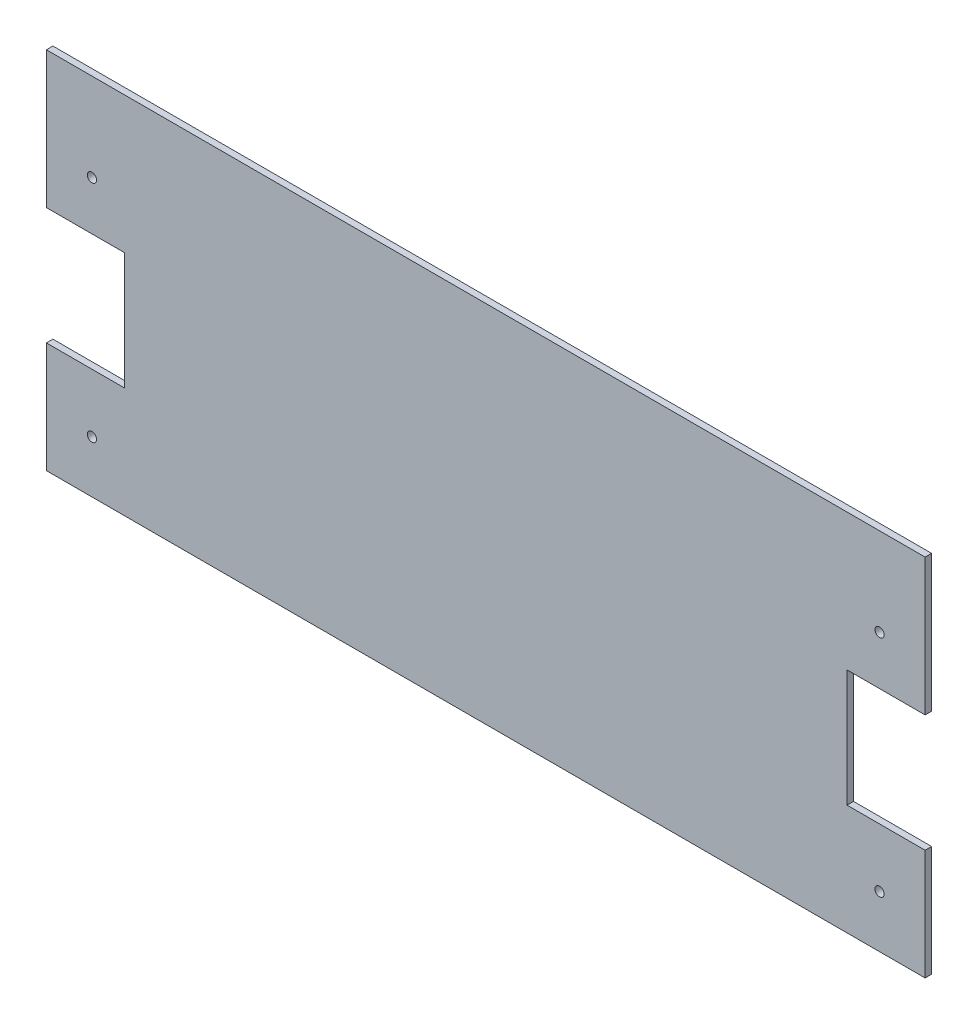
ISO-10303-21;
HEADER;
FILE_DESCRIPTION(('STEP AP214'),'2;1');
FILE_NAME('part.step','',(''),(''),'','','');
FILE_SCHEMA(('AUTOMOTIVE_DESIGN { 1 0 10303 214 1 1 1 1 }'));
ENDSEC;
DATA;
#1=APPLICATION_CONTEXT('core data for automotive mechanical design processes');
#2=APPLICATION_PROTOCOL_DEFINITION('international standard','automotive_design',2000,#1);
#3=PRODUCT_CONTEXT('',#1,'mechanical');
#4=PRODUCT('Part','Part','',(#3));
#5=PRODUCT_RELATED_PRODUCT_CATEGORY('part','',(#4));
#6=PRODUCT_DEFINITION_FORMATION('','',#4);
#7=PRODUCT_DEFINITION_CONTEXT('part definition',#1,'design');
#8=PRODUCT_DEFINITION('design','',#6,#7);
#9=PRODUCT_DEFINITION_SHAPE('','',#8);
#10=(LENGTH_UNIT() NAMED_UNIT(*) SI_UNIT(.MILLI.,.METRE.));
#11=(NAMED_UNIT(*) PLANE_ANGLE_UNIT() SI_UNIT($,.RADIAN.));
#12=(NAMED_UNIT(*) SI_UNIT($,.STERADIAN.) SOLID_ANGLE_UNIT());
#13=UNCERTAINTY_MEASURE_WITH_UNIT(LENGTH_MEASURE(1.E-05),#10,'distance_accuracy_value','');
#14=(GEOMETRIC_REPRESENTATION_CONTEXT(3) GLOBAL_UNCERTAINTY_ASSIGNED_CONTEXT((#13)) GLOBAL_UNIT_ASSIGNED_CONTEXT((#10,
#11,#12)) REPRESENTATION_CONTEXT('',''));
#15=CARTESIAN_POINT('',(0.,0.,0.));
#16=DIRECTION('',(0.,0.,1.));
#17=DIRECTION('',(1.,0.,0.));
#18=AXIS2_PLACEMENT_3D('',#15,#16,#17);
#19=CARTESIAN_POINT('',(214.3125,0.,-3.175));
#20=DIRECTION('',(1.,0.,0.));
#21=DIRECTION('',(0.,0.,-1.));
#22=AXIS2_PLACEMENT_3D('',#19,#20,#21);
#23=PLANE('',#22);
#24=DIRECTION('',(0.,1.,0.));
#25=VECTOR('',#24,1.);
#26=CARTESIAN_POINT('',(214.3125,0.,0.));
#27=LINE('',#26,#25);
#28=CARTESIAN_POINT('',(214.3125,-88.9,0.));
#29=VERTEX_POINT('',#28);
#30=CARTESIAN_POINT('',(214.3125,-34.925,0.));
#31=VERTEX_POINT('',#30);
#32=EDGE_CURVE('E191',#29,#31,#27,.T.);
#33=ORIENTED_EDGE('',*,*,#32,.F.);
#34=DIRECTION('',(0.,0.,1.));
#35=VECTOR('',#34,1.);
#36=CARTESIAN_POINT('',(214.3125,-88.9,-3.175));
#37=LINE('',#36,#35);
#38=CARTESIAN_POINT('',(214.3125,-88.9,-3.175));
#39=VERTEX_POINT('',#38);
#40=EDGE_CURVE('E11',#39,#29,#37,.T.);
#41=ORIENTED_EDGE('',*,*,#40,.F.);
#42=DIRECTION('',(0.,1.,0.));
#43=VECTOR('',#42,1.);
#44=CARTESIAN_POINT('',(214.3125,0.,-3.175));
#45=LINE('',#44,#43);
#46=CARTESIAN_POINT('',(214.3125,-34.925,-3.175));
#47=VERTEX_POINT('',#46);
#48=EDGE_CURVE('E237',#39,#47,#45,.T.);
#49=ORIENTED_EDGE('',*,*,#48,.T.);
#50=DIRECTION('',(0.,0.,1.));
#51=VECTOR('',#50,1.);
#52=CARTESIAN_POINT('',(214.3125,-34.925,-3.175));
#53=LINE('',#52,#51);
#54=EDGE_CURVE('E43',#47,#31,#53,.T.);
#55=ORIENTED_EDGE('',*,*,#54,.T.);
#56=EDGE_LOOP('',(#33,#41,#49,#55));
#57=FACE_BOUND('',#56,.T.);
#58=ADVANCED_FACE('F39',(#57),#23,.T.);
#59=CARTESIAN_POINT('',(0.,-88.9,-3.175));
#60=DIRECTION('',(0.,-1.,0.));
#61=DIRECTION('',(0.,0.,-1.));
#62=AXIS2_PLACEMENT_3D('',#59,#60,#61);
#63=PLANE('',#62);
#64=DIRECTION('',(1.,0.,0.));
#65=VECTOR('',#64,1.);
#66=CARTESIAN_POINT('',(0.,-88.9,0.));
#67=LINE('',#66,#65);
#68=CARTESIAN_POINT('',(-214.3125,-88.9,0.));
#69=VERTEX_POINT('',#68);
#70=EDGE_CURVE('E218',#69,#29,#67,.T.);
#71=ORIENTED_EDGE('',*,*,#70,.F.);
#72=DIRECTION('',(0.,0.,1.));
#73=VECTOR('',#72,1.);
#74=CARTESIAN_POINT('',(-214.3125,-88.9,-3.175));
#75=LINE('',#74,#73);
#76=CARTESIAN_POINT('',(-214.3125,-88.9,-3.175));
#77=VERTEX_POINT('',#76);
#78=EDGE_CURVE('E49',#77,#69,#75,.T.);
#79=ORIENTED_EDGE('',*,*,#78,.F.);
#80=DIRECTION('',(1.,0.,0.));
#81=VECTOR('',#80,1.);
#82=CARTESIAN_POINT('',(0.,-88.9,-3.175));
#83=LINE('',#82,#81);
#84=EDGE_CURVE('E152',#77,#39,#83,.T.);
#85=ORIENTED_EDGE('',*,*,#84,.T.);
#86=ORIENTED_EDGE('',*,*,#40,.T.);
#87=EDGE_LOOP('',(#71,#79,#85,#86));
#88=FACE_BOUND('',#87,.T.);
#89=ADVANCED_FACE('F295',(#88),#63,.T.);
#90=CARTESIAN_POINT('',(-214.3125,0.,-3.175));
#91=DIRECTION('',(1.,0.,0.));
#92=DIRECTION('',(0.,0.,-1.));
#93=AXIS2_PLACEMENT_3D('',#90,#91,#92);
#94=PLANE('',#93);
#95=DIRECTION('',(0.,1.,0.));
#96=VECTOR('',#95,1.);
#97=CARTESIAN_POINT('',(-214.3125,0.,0.));
#98=LINE('',#97,#96);
#99=CARTESIAN_POINT('',(-214.3125,-34.925,0.));
#100=VERTEX_POINT('',#99);
#101=EDGE_CURVE('E156',#69,#100,#98,.T.);
#102=ORIENTED_EDGE('',*,*,#101,.T.);
#103=DIRECTION('',(0.,0.,1.));
#104=VECTOR('',#103,1.);
#105=CARTESIAN_POINT('',(-214.3125,-34.925,-3.175));
#106=LINE('',#105,#104);
#107=CARTESIAN_POINT('',(-214.3125,-34.925,-3.175));
#108=VERTEX_POINT('',#107);
#109=EDGE_CURVE('E142',#108,#100,#106,.T.);
#110=ORIENTED_EDGE('',*,*,#109,.F.);
#111=DIRECTION('',(0.,1.,0.));
#112=VECTOR('',#111,1.);
#113=CARTESIAN_POINT('',(-214.3125,0.,-3.175));
#114=LINE('',#113,#112);
#115=EDGE_CURVE('E146',#77,#108,#114,.T.);
#116=ORIENTED_EDGE('',*,*,#115,.F.);
#117=ORIENTED_EDGE('',*,*,#78,.T.);
#118=EDGE_LOOP('',(#102,#110,#116,#117));
#119=FACE_BOUND('',#118,.T.);
#120=ADVANCED_FACE('F155',(#119),#94,.F.);
#121=CARTESIAN_POINT('',(0.,-34.925,-3.175));
#122=DIRECTION('',(0.,-1.,0.));
#123=DIRECTION('',(0.,0.,-1.));
#124=AXIS2_PLACEMENT_3D('',#121,#122,#123);
#125=PLANE('',#124);
#126=DIRECTION('',(1.,0.,0.));
#127=VECTOR('',#126,1.);
#128=CARTESIAN_POINT('',(0.,-34.925,0.));
#129=LINE('',#128,#127);
#130=CARTESIAN_POINT('',(-176.2125,-34.925,0.));
#131=VERTEX_POINT('',#130);
#132=EDGE_CURVE('E216',#100,#131,#129,.T.);
#133=ORIENTED_EDGE('',*,*,#132,.T.);
#134=DIRECTION('',(0.,0.,1.));
#135=VECTOR('',#134,1.);
#136=CARTESIAN_POINT('',(-176.2125,-34.925,-3.175));
#137=LINE('',#136,#135);
#138=CARTESIAN_POINT('',(-176.2125,-34.925,-3.175));
#139=VERTEX_POINT('',#138);
#140=EDGE_CURVE('E144',#139,#131,#137,.T.);
#141=ORIENTED_EDGE('',*,*,#140,.F.);
#142=DIRECTION('',(1.,0.,0.));
#143=VECTOR('',#142,1.);
#144=CARTESIAN_POINT('',(0.,-34.925,-3.175));
#145=LINE('',#144,#143);
#146=EDGE_CURVE('E137',#108,#139,#145,.T.);
#147=ORIENTED_EDGE('',*,*,#146,.F.);
#148=ORIENTED_EDGE('',*,*,#109,.T.);
#149=EDGE_LOOP('',(#133,#141,#147,#148));
#150=FACE_BOUND('',#149,.T.);
#151=ADVANCED_FACE('F140',(#150),#125,.F.);
#152=CARTESIAN_POINT('',(-176.2125,0.,-3.175));
#153=DIRECTION('',(1.,0.,0.));
#154=DIRECTION('',(0.,0.,-1.));
#155=AXIS2_PLACEMENT_3D('',#152,#153,#154);
#156=PLANE('',#155);
#157=DIRECTION('',(0.,1.,0.));
#158=VECTOR('',#157,1.);
#159=CARTESIAN_POINT('',(-176.2125,0.,0.));
#160=LINE('',#159,#158);
#161=CARTESIAN_POINT('',(-176.2125,22.225,0.));
#162=VERTEX_POINT('',#161);
#163=EDGE_CURVE('E213',#131,#162,#160,.T.);
#164=ORIENTED_EDGE('',*,*,#163,.T.);
#165=DIRECTION('',(0.,0.,1.));
#166=VECTOR('',#165,1.);
#167=CARTESIAN_POINT('',(-176.2125,22.225,-3.175));
#168=LINE('',#167,#166);
#169=CARTESIAN_POINT('',(-176.2125,22.225,-3.175));
#170=VERTEX_POINT('',#169);
#171=EDGE_CURVE('E159',#170,#162,#168,.T.);
#172=ORIENTED_EDGE('',*,*,#171,.F.);
#173=DIRECTION('',(0.,1.,0.));
#174=VECTOR('',#173,1.);
#175=CARTESIAN_POINT('',(-176.2125,0.,-3.175));
#176=LINE('',#175,#174);
#177=EDGE_CURVE('E147',#139,#170,#176,.T.);
#178=ORIENTED_EDGE('',*,*,#177,.F.);
#179=ORIENTED_EDGE('',*,*,#140,.T.);
#180=EDGE_LOOP('',(#164,#172,#178,#179));
#181=FACE_BOUND('',#180,.T.);
#182=ADVANCED_FACE('F256',(#181),#156,.F.);
#183=CARTESIAN_POINT('',(0.,22.225,-3.175));
#184=DIRECTION('',(0.,-1.,0.));
#185=DIRECTION('',(0.,0.,-1.));
#186=AXIS2_PLACEMENT_3D('',#183,#184,#185);
#187=PLANE('',#186);
#188=DIRECTION('',(1.,0.,0.));
#189=VECTOR('',#188,1.);
#190=CARTESIAN_POINT('',(0.,22.225,0.));
#191=LINE('',#190,#189);
#192=CARTESIAN_POINT('',(-214.3125,22.225,0.));
#193=VERTEX_POINT('',#192);
#194=EDGE_CURVE('E210',#193,#162,#191,.T.);
#195=ORIENTED_EDGE('',*,*,#194,.F.);
#196=DIRECTION('',(0.,0.,1.));
#197=VECTOR('',#196,1.);
#198=CARTESIAN_POINT('',(-214.3125,22.225,-3.175));
#199=LINE('',#198,#197);
#200=CARTESIAN_POINT('',(-214.3125,22.225,-3.175));
#201=VERTEX_POINT('',#200);
#202=EDGE_CURVE('E163',#201,#193,#199,.T.);
#203=ORIENTED_EDGE('',*,*,#202,.F.);
#204=DIRECTION('',(1.,0.,0.));
#205=VECTOR('',#204,1.);
#206=CARTESIAN_POINT('',(0.,22.225,-3.175));
#207=LINE('',#206,#205);
#208=EDGE_CURVE('E250',#201,#170,#207,.T.);
#209=ORIENTED_EDGE('',*,*,#208,.T.);
#210=ORIENTED_EDGE('',*,*,#171,.T.);
#211=EDGE_LOOP('',(#195,#203,#209,#210));
#212=FACE_BOUND('',#211,.T.);
#213=ADVANCED_FACE('F259',(#212),#187,.T.);
#214=CARTESIAN_POINT('',(-214.3125,88.9,0.));
#215=VERTEX_POINT('',#214);
#216=EDGE_CURVE('E207',#193,#215,#98,.T.);
#217=ORIENTED_EDGE('',*,*,#216,.T.);
#218=DIRECTION('',(0.,0.,1.));
#219=VECTOR('',#218,1.);
#220=CARTESIAN_POINT('',(-214.3125,88.9,-3.175));
#221=LINE('',#220,#219);
#222=CARTESIAN_POINT('',(-214.3125,88.9,-3.175));
#223=VERTEX_POINT('',#222);
#224=EDGE_CURVE('E165',#223,#215,#221,.T.);
#225=ORIENTED_EDGE('',*,*,#224,.F.);
#226=EDGE_CURVE('E154',#201,#223,#114,.T.);
#227=ORIENTED_EDGE('',*,*,#226,.F.);
#228=ORIENTED_EDGE('',*,*,#202,.T.);
#229=EDGE_LOOP('',(#217,#225,#227,#228));
#230=FACE_BOUND('',#229,.T.);
#231=ADVANCED_FACE('F264',(#230),#94,.F.);
#232=CARTESIAN_POINT('',(0.,88.9,-3.175));
#233=DIRECTION('',(0.,-1.,0.));
#234=DIRECTION('',(0.,0.,-1.));
#235=AXIS2_PLACEMENT_3D('',#232,#233,#234);
#236=PLANE('',#235);
#237=DIRECTION('',(1.,0.,0.));
#238=VECTOR('',#237,1.);
#239=CARTESIAN_POINT('',(0.,88.9,0.));
#240=LINE('',#239,#238);
#241=CARTESIAN_POINT('',(214.3125,88.9,0.));
#242=VERTEX_POINT('',#241);
#243=EDGE_CURVE('E204',#215,#242,#240,.T.);
#244=ORIENTED_EDGE('',*,*,#243,.T.);
#245=DIRECTION('',(0.,0.,1.));
#246=VECTOR('',#245,1.);
#247=CARTESIAN_POINT('',(214.3125,88.9,-3.175));
#248=LINE('',#247,#246);
#249=CARTESIAN_POINT('',(214.3125,88.9,-3.175));
#250=VERTEX_POINT('',#249);
#251=EDGE_CURVE('E168',#250,#242,#248,.T.);
#252=ORIENTED_EDGE('',*,*,#251,.F.);
#253=DIRECTION('',(1.,0.,0.));
#254=VECTOR('',#253,1.);
#255=CARTESIAN_POINT('',(0.,88.9,-3.175));
#256=LINE('',#255,#254);
#257=EDGE_CURVE('E247',#223,#250,#256,.T.);
#258=ORIENTED_EDGE('',*,*,#257,.F.);
#259=ORIENTED_EDGE('',*,*,#224,.T.);
#260=EDGE_LOOP('',(#244,#252,#258,#259));
#261=FACE_BOUND('',#260,.T.);
#262=ADVANCED_FACE('F269',(#261),#236,.F.);
#263=CARTESIAN_POINT('',(214.3125,22.225,0.));
#264=VERTEX_POINT('',#263);
#265=EDGE_CURVE('E195',#264,#242,#27,.T.);
#266=ORIENTED_EDGE('',*,*,#265,.F.);
#267=DIRECTION('',(0.,0.,1.));
#268=VECTOR('',#267,1.);
#269=CARTESIAN_POINT('',(214.3125,22.225,-3.175));
#270=LINE('',#269,#268);
#271=CARTESIAN_POINT('',(214.3125,22.225,-3.175));
#272=VERTEX_POINT('',#271);
#273=EDGE_CURVE('E170',#272,#264,#270,.T.);
#274=ORIENTED_EDGE('',*,*,#273,.F.);
#275=EDGE_CURVE('E240',#272,#250,#45,.T.);
#276=ORIENTED_EDGE('',*,*,#275,.T.);
#277=ORIENTED_EDGE('',*,*,#251,.T.);
#278=EDGE_LOOP('',(#266,#274,#276,#277));
#279=FACE_BOUND('',#278,.T.);
#280=ADVANCED_FACE('F273',(#279),#23,.T.);
#281=CARTESIAN_POINT('',(0.,22.225,-3.175));
#282=DIRECTION('',(0.,1.,0.));
#283=DIRECTION('',(0.,0.,1.));
#284=AXIS2_PLACEMENT_3D('',#281,#282,#283);
#285=PLANE('',#284);
#286=DIRECTION('',(-1.,0.,0.));
#287=VECTOR('',#286,1.);
#288=CARTESIAN_POINT('',(0.,22.225,0.));
#289=LINE('',#288,#287);
#290=CARTESIAN_POINT('',(176.2125,22.225,0.));
#291=VERTEX_POINT('',#290);
#292=EDGE_CURVE('E201',#264,#291,#289,.T.);
#293=ORIENTED_EDGE('',*,*,#292,.T.);
#294=DIRECTION('',(0.,0.,1.));
#295=VECTOR('',#294,1.);
#296=CARTESIAN_POINT('',(176.2125,22.225,-3.175));
#297=LINE('',#296,#295);
#298=CARTESIAN_POINT('',(176.2125,22.225,-3.175));
#299=VERTEX_POINT('',#298);
#300=EDGE_CURVE('E172',#299,#291,#297,.T.);
#301=ORIENTED_EDGE('',*,*,#300,.F.);
#302=DIRECTION('',(-1.,0.,0.));
#303=VECTOR('',#302,1.);
#304=CARTESIAN_POINT('',(0.,22.225,-3.175));
#305=LINE('',#304,#303);
#306=EDGE_CURVE('E245',#272,#299,#305,.T.);
#307=ORIENTED_EDGE('',*,*,#306,.F.);
#308=ORIENTED_EDGE('',*,*,#273,.T.);
#309=EDGE_LOOP('',(#293,#301,#307,#308));
#310=FACE_BOUND('',#309,.T.);
#311=ADVANCED_FACE('F278',(#310),#285,.F.);
#312=CARTESIAN_POINT('',(176.2125,0.,-3.175));
#313=DIRECTION('',(1.,0.,0.));
#314=DIRECTION('',(0.,0.,-1.));
#315=AXIS2_PLACEMENT_3D('',#312,#313,#314);
#316=PLANE('',#315);
#317=DIRECTION('',(0.,1.,0.));
#318=VECTOR('',#317,1.);
#319=CARTESIAN_POINT('',(176.2125,0.,0.));
#320=LINE('',#319,#318);
#321=CARTESIAN_POINT('',(176.2125,-34.925,0.));
#322=VERTEX_POINT('',#321);
#323=EDGE_CURVE('E198',#322,#291,#320,.T.);
#324=ORIENTED_EDGE('',*,*,#323,.F.);
#325=DIRECTION('',(0.,0.,1.));
#326=VECTOR('',#325,1.);
#327=CARTESIAN_POINT('',(176.2125,-34.925,-3.175));
#328=LINE('',#327,#326);
#329=CARTESIAN_POINT('',(176.2125,-34.925,-3.175));
#330=VERTEX_POINT('',#329);
#331=EDGE_CURVE('E173',#330,#322,#328,.T.);
#332=ORIENTED_EDGE('',*,*,#331,.F.);
#333=DIRECTION('',(0.,1.,0.));
#334=VECTOR('',#333,1.);
#335=CARTESIAN_POINT('',(176.2125,0.,-3.175));
#336=LINE('',#335,#334);
#337=EDGE_CURVE('E242',#330,#299,#336,.T.);
#338=ORIENTED_EDGE('',*,*,#337,.T.);
#339=ORIENTED_EDGE('',*,*,#300,.T.);
#340=EDGE_LOOP('',(#324,#332,#338,#339));
#341=FACE_BOUND('',#340,.T.);
#342=ADVANCED_FACE('F284',(#341),#316,.T.);
#343=CARTESIAN_POINT('',(0.,-34.925,-3.175));
#344=DIRECTION('',(0.,1.,0.));
#345=DIRECTION('',(0.,0.,1.));
#346=AXIS2_PLACEMENT_3D('',#343,#344,#345);
#347=PLANE('',#346);
#348=DIRECTION('',(-1.,0.,0.));
#349=VECTOR('',#348,1.);
#350=CARTESIAN_POINT('',(0.,-34.925,0.));
#351=LINE('',#350,#349);
#352=EDGE_CURVE('E194',#31,#322,#351,.T.);
#353=ORIENTED_EDGE('',*,*,#352,.F.);
#354=ORIENTED_EDGE('',*,*,#54,.F.);
#355=DIRECTION('',(-1.,0.,0.));
#356=VECTOR('',#355,1.);
#357=CARTESIAN_POINT('',(0.,-34.925,-3.175));
#358=LINE('',#357,#356);
#359=EDGE_CURVE('E239',#47,#330,#358,.T.);
#360=ORIENTED_EDGE('',*,*,#359,.T.);
#361=ORIENTED_EDGE('',*,*,#331,.T.);
#362=EDGE_LOOP('',(#353,#354,#360,#361));
#363=FACE_BOUND('',#362,.T.);
#364=ADVANCED_FACE('F281',(#363),#347,.T.);
#365=CARTESIAN_POINT('',(-192.0875,46.0375,-3.175));
#366=DIRECTION('',(0.,0.,1.));
#367=DIRECTION('',(1.,0.,0.));
#368=AXIS2_PLACEMENT_3D('',#365,#366,#367);
#369=CYLINDRICAL_SURFACE('',#368,2.25000000000001);
#370=CARTESIAN_POINT('',(-192.0875,46.0375,-3.175));
#371=DIRECTION('',(0.,0.,1.));
#372=DIRECTION('',(1.,0.,0.));
#373=AXIS2_PLACEMENT_3D('',#370,#371,#372);
#374=CIRCLE('',#373,2.25000000000001);
#375=CARTESIAN_POINT('',(-189.8375,46.0375,-3.175));
#376=VERTEX_POINT('',#375);
#377=EDGE_CURVE('E232',#376,#376,#374,.T.);
#378=ORIENTED_EDGE('',*,*,#377,.F.);
#379=EDGE_LOOP('',(#378));
#380=FACE_BOUND('',#379,.T.);
#381=CARTESIAN_POINT('',(-192.0875,46.0375,0.));
#382=DIRECTION('',(0.,0.,1.));
#383=DIRECTION('',(1.,0.,0.));
#384=AXIS2_PLACEMENT_3D('',#381,#382,#383);
#385=CIRCLE('',#384,2.25000000000001);
#386=CARTESIAN_POINT('',(-189.8375,46.0375,0.));
#387=VERTEX_POINT('',#386);
#388=EDGE_CURVE('E188',#387,#387,#385,.T.);
#389=ORIENTED_EDGE('',*,*,#388,.T.);
#390=EDGE_LOOP('',(#389));
#391=FACE_BOUND('',#390,.T.);
#392=ADVANCED_FACE('F283',(#380,#391),#369,.F.);
#393=CARTESIAN_POINT('',(-192.0875,-63.5,-3.175));
#394=DIRECTION('',(0.,0.,1.));
#395=DIRECTION('',(1.,0.,0.));
#396=AXIS2_PLACEMENT_3D('',#393,#394,#395);
#397=CYLINDRICAL_SURFACE('',#396,2.25000000000001);
#398=CARTESIAN_POINT('',(-192.0875,-63.5,-3.175));
#399=DIRECTION('',(0.,0.,1.));
#400=DIRECTION('',(1.,0.,0.));
#401=AXIS2_PLACEMENT_3D('',#398,#399,#400);
#402=CIRCLE('',#401,2.25000000000001);
#403=CARTESIAN_POINT('',(-189.8375,-63.5,-3.175));
#404=VERTEX_POINT('',#403);
#405=EDGE_CURVE('E227',#404,#404,#402,.T.);
#406=ORIENTED_EDGE('',*,*,#405,.F.);
#407=EDGE_LOOP('',(#406));
#408=FACE_BOUND('',#407,.T.);
#409=CARTESIAN_POINT('',(-192.0875,-63.5,0.));
#410=DIRECTION('',(0.,0.,1.));
#411=DIRECTION('',(1.,0.,0.));
#412=AXIS2_PLACEMENT_3D('',#409,#410,#411);
#413=CIRCLE('',#412,2.25000000000001);
#414=CARTESIAN_POINT('',(-189.8375,-63.5,0.));
#415=VERTEX_POINT('',#414);
#416=EDGE_CURVE('E185',#415,#415,#413,.T.);
#417=ORIENTED_EDGE('',*,*,#416,.T.);
#418=EDGE_LOOP('',(#417));
#419=FACE_BOUND('',#418,.T.);
#420=ADVANCED_FACE('F290',(#408,#419),#397,.F.);
#421=CARTESIAN_POINT('',(192.0875,-63.5,-3.175));
#422=DIRECTION('',(0.,0.,1.));
#423=DIRECTION('',(1.,0.,0.));
#424=AXIS2_PLACEMENT_3D('',#421,#422,#423);
#425=CYLINDRICAL_SURFACE('',#424,2.25000000000001);
#426=CARTESIAN_POINT('',(192.0875,-63.5,-3.175));
#427=DIRECTION('',(0.,0.,1.));
#428=DIRECTION('',(1.,0.,0.));
#429=AXIS2_PLACEMENT_3D('',#426,#427,#428);
#430=CIRCLE('',#429,2.25000000000001);
#431=CARTESIAN_POINT('',(194.3375,-63.5,-3.175));
#432=VERTEX_POINT('',#431);
#433=EDGE_CURVE('E223',#432,#432,#430,.F.);
#434=ORIENTED_EDGE('',*,*,#433,.T.);
#435=EDGE_LOOP('',(#434));
#436=FACE_BOUND('',#435,.T.);
#437=CARTESIAN_POINT('',(192.0875,-63.5,0.));
#438=DIRECTION('',(0.,0.,1.));
#439=DIRECTION('',(1.,0.,0.));
#440=AXIS2_PLACEMENT_3D('',#437,#438,#439);
#441=CIRCLE('',#440,2.25000000000001);
#442=CARTESIAN_POINT('',(194.3375,-63.5,0.));
#443=VERTEX_POINT('',#442);
#444=EDGE_CURVE('E182',#443,#443,#441,.F.);
#445=ORIENTED_EDGE('',*,*,#444,.F.);
#446=EDGE_LOOP('',(#445));
#447=FACE_BOUND('',#446,.T.);
#448=ADVANCED_FACE('F41',(#436,#447),#425,.F.);
#449=CARTESIAN_POINT('',(192.0875,46.0375,-3.175));
#450=DIRECTION('',(0.,0.,1.));
#451=DIRECTION('',(1.,0.,0.));
#452=AXIS2_PLACEMENT_3D('',#449,#450,#451);
#453=CYLINDRICAL_SURFACE('',#452,2.25000000000001);
#454=CARTESIAN_POINT('',(192.0875,46.0375,-3.175));
#455=DIRECTION('',(0.,0.,1.));
#456=DIRECTION('',(1.,0.,0.));
#457=AXIS2_PLACEMENT_3D('',#454,#455,#456);
#458=CIRCLE('',#457,2.25000000000001);
#459=CARTESIAN_POINT('',(194.3375,46.0375,-3.175));
#460=VERTEX_POINT('',#459);
#461=EDGE_CURVE('E175',#460,#460,#458,.F.);
#462=ORIENTED_EDGE('',*,*,#461,.T.);
#463=EDGE_LOOP('',(#462));
#464=FACE_BOUND('',#463,.T.);
#465=CARTESIAN_POINT('',(192.0875,46.0375,0.));
#466=DIRECTION('',(0.,0.,1.));
#467=DIRECTION('',(1.,0.,0.));
#468=AXIS2_PLACEMENT_3D('',#465,#466,#467);
#469=CIRCLE('',#468,2.25000000000001);
#470=CARTESIAN_POINT('',(194.3375,46.0375,0.));
#471=VERTEX_POINT('',#470);
#472=EDGE_CURVE('E221',#471,#471,#469,.F.);
#473=ORIENTED_EDGE('',*,*,#472,.F.);
#474=EDGE_LOOP('',(#473));
#475=FACE_BOUND('',#474,.T.);
#476=ADVANCED_FACE('F320',(#464,#475),#453,.F.);
#477=CARTESIAN_POINT('',(0.,0.,-3.175));
#478=DIRECTION('',(0.,0.,1.));
#479=DIRECTION('',(1.,0.,0.));
#480=AXIS2_PLACEMENT_3D('',#477,#478,#479);
#481=PLANE('',#480);
#482=ORIENTED_EDGE('',*,*,#433,.F.);
#483=EDGE_LOOP('',(#482));
#484=FACE_BOUND('',#483,.T.);
#485=ORIENTED_EDGE('',*,*,#405,.T.);
#486=EDGE_LOOP('',(#485));
#487=FACE_BOUND('',#486,.T.);
#488=ORIENTED_EDGE('',*,*,#377,.T.);
#489=EDGE_LOOP('',(#488));
#490=FACE_BOUND('',#489,.T.);
#491=ORIENTED_EDGE('',*,*,#48,.F.);
#492=ORIENTED_EDGE('',*,*,#84,.F.);
#493=ORIENTED_EDGE('',*,*,#115,.T.);
#494=ORIENTED_EDGE('',*,*,#146,.T.);
#495=ORIENTED_EDGE('',*,*,#177,.T.);
#496=ORIENTED_EDGE('',*,*,#208,.F.);
#497=ORIENTED_EDGE('',*,*,#226,.T.);
#498=ORIENTED_EDGE('',*,*,#257,.T.);
#499=ORIENTED_EDGE('',*,*,#275,.F.);
#500=ORIENTED_EDGE('',*,*,#306,.T.);
#501=ORIENTED_EDGE('',*,*,#337,.F.);
#502=ORIENTED_EDGE('',*,*,#359,.F.);
#503=EDGE_LOOP('',(#491,#492,#493,#494,#495,#496,#497,#498,#499,#500,#501,#502));
#504=FACE_BOUND('',#503,.T.);
#505=ORIENTED_EDGE('',*,*,#461,.F.);
#506=EDGE_LOOP('',(#505));
#507=FACE_BOUND('',#506,.T.);
#508=ADVANCED_FACE('F150',(#484,#487,#490,#504,#507),#481,.F.);
#509=CARTESIAN_POINT('',(0.,0.,0.));
#510=DIRECTION('',(0.,0.,1.));
#511=DIRECTION('',(1.,0.,0.));
#512=AXIS2_PLACEMENT_3D('',#509,#510,#511);
#513=PLANE('',#512);
#514=ORIENTED_EDGE('',*,*,#444,.T.);
#515=EDGE_LOOP('',(#514));
#516=FACE_BOUND('',#515,.T.);
#517=ORIENTED_EDGE('',*,*,#416,.F.);
#518=EDGE_LOOP('',(#517));
#519=FACE_BOUND('',#518,.T.);
#520=ORIENTED_EDGE('',*,*,#388,.F.);
#521=EDGE_LOOP('',(#520));
#522=FACE_BOUND('',#521,.T.);
#523=ORIENTED_EDGE('',*,*,#32,.T.);
#524=ORIENTED_EDGE('',*,*,#352,.T.);
#525=ORIENTED_EDGE('',*,*,#323,.T.);
#526=ORIENTED_EDGE('',*,*,#292,.F.);
#527=ORIENTED_EDGE('',*,*,#265,.T.);
#528=ORIENTED_EDGE('',*,*,#243,.F.);
#529=ORIENTED_EDGE('',*,*,#216,.F.);
#530=ORIENTED_EDGE('',*,*,#194,.T.);
#531=ORIENTED_EDGE('',*,*,#163,.F.);
#532=ORIENTED_EDGE('',*,*,#132,.F.);
#533=ORIENTED_EDGE('',*,*,#101,.F.);
#534=ORIENTED_EDGE('',*,*,#70,.T.);
#535=EDGE_LOOP('',(#523,#524,#525,#526,#527,#528,#529,#530,#531,#532,#533,#534));
#536=FACE_BOUND('',#535,.T.);
#537=ORIENTED_EDGE('',*,*,#472,.T.);
#538=EDGE_LOOP('',(#537));
#539=FACE_BOUND('',#538,.T.);
#540=ADVANCED_FACE('F323',(#516,#519,#522,#536,#539),#513,.T.);
#541=CLOSED_SHELL('',(#58,#89,#120,#151,#182,#213,#231,#262,#280,#311,#342,#364,#392,#420,#448,
#476,#508,#540));
#542=MANIFOLD_SOLID_BREP('B2',#541);
#543=ADVANCED_BREP_SHAPE_REPRESENTATION('',(#18,#542),#14);
#544=SHAPE_DEFINITION_REPRESENTATION(#9,#543);
ENDSEC;
END-ISO-10303-21;
